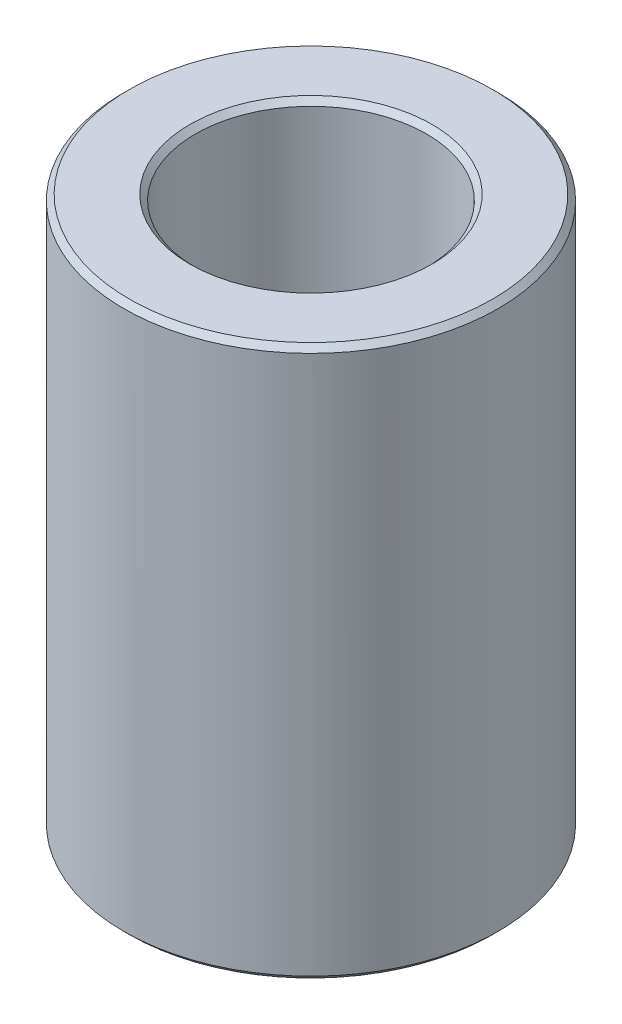
ISO-10303-21;
HEADER;
FILE_DESCRIPTION(('STEP AP214'),'2;1');
FILE_NAME('part.step','',(''),(''),'','','');
FILE_SCHEMA(('AUTOMOTIVE_DESIGN { 1 0 10303 214 1 1 1 1 }'));
ENDSEC;
DATA;
#1=APPLICATION_CONTEXT('core data for automotive mechanical design processes');
#2=APPLICATION_PROTOCOL_DEFINITION('international standard','automotive_design',2000,#1);
#3=PRODUCT_CONTEXT('',#1,'mechanical');
#4=PRODUCT('Part','Part','',(#3));
#5=PRODUCT_RELATED_PRODUCT_CATEGORY('part','',(#4));
#6=PRODUCT_DEFINITION_FORMATION('','',#4);
#7=PRODUCT_DEFINITION_CONTEXT('part definition',#1,'design');
#8=PRODUCT_DEFINITION('design','',#6,#7);
#9=PRODUCT_DEFINITION_SHAPE('','',#8);
#10=(LENGTH_UNIT() NAMED_UNIT(*) SI_UNIT(.MILLI.,.METRE.));
#11=(NAMED_UNIT(*) PLANE_ANGLE_UNIT() SI_UNIT($,.RADIAN.));
#12=(NAMED_UNIT(*) SI_UNIT($,.STERADIAN.) SOLID_ANGLE_UNIT());
#13=UNCERTAINTY_MEASURE_WITH_UNIT(LENGTH_MEASURE(1.E-05),#10,'distance_accuracy_value','');
#14=(GEOMETRIC_REPRESENTATION_CONTEXT(3) GLOBAL_UNCERTAINTY_ASSIGNED_CONTEXT((#13)) GLOBAL_UNIT_ASSIGNED_CONTEXT((#10,
#11,#12)) REPRESENTATION_CONTEXT('',''));
#15=CARTESIAN_POINT('',(0.,0.,0.));
#16=DIRECTION('',(0.,0.,1.));
#17=DIRECTION('',(1.,0.,0.));
#18=AXIS2_PLACEMENT_3D('',#15,#16,#17);
#19=CARTESIAN_POINT('',(0.,25.4,0.));
#20=DIRECTION('',(0.,-1.,0.));
#21=DIRECTION('',(0.,0.,-1.));
#22=AXIS2_PLACEMENT_3D('',#19,#20,#21);
#23=CYLINDRICAL_SURFACE('',#22,5.334);
#24=CARTESIAN_POINT('',(0.,0.254000000040833,0.));
#25=DIRECTION('',(0.,-1.,0.));
#26=DIRECTION('',(0.,0.,-1.));
#27=AXIS2_PLACEMENT_3D('',#24,#25,#26);
#28=CIRCLE('',#27,5.33400000000483);
#29=CARTESIAN_POINT('',(0.,0.254000000040833,-5.33400000000483));
#30=VERTEX_POINT('',#29);
#31=EDGE_CURVE('E30',#30,#30,#28,.T.);
#32=ORIENTED_EDGE('',*,*,#31,.T.);
#33=EDGE_LOOP('',(#32));
#34=FACE_BOUND('',#33,.T.);
#35=CARTESIAN_POINT('',(0.,25.1460000000066,0.));
#36=DIRECTION('',(0.,1.,0.));
#37=DIRECTION('',(0.,0.,1.));
#38=AXIS2_PLACEMENT_3D('',#35,#36,#37);
#39=CIRCLE('',#38,5.33400000000483);
#40=CARTESIAN_POINT('',(0.,25.1460000000066,5.33400000000483));
#41=VERTEX_POINT('',#40);
#42=EDGE_CURVE('E33',#41,#41,#39,.T.);
#43=ORIENTED_EDGE('',*,*,#42,.T.);
#44=EDGE_LOOP('',(#43));
#45=FACE_BOUND('',#44,.T.);
#46=ADVANCED_FACE('F15',(#34,#45),#23,.F.);
#47=CARTESIAN_POINT('',(0.,25.3999999999337,0.));
#48=DIRECTION('',(0.,1.,0.));
#49=DIRECTION('',(0.,0.,1.));
#50=AXIS2_PLACEMENT_3D('',#47,#48,#49);
#51=CONICAL_SURFACE('',#50,5.58799999993198,0.785398163397448);
#52=ORIENTED_EDGE('',*,*,#42,.F.);
#53=EDGE_LOOP('',(#52));
#54=FACE_BOUND('',#53,.T.);
#55=CARTESIAN_POINT('',(0.,25.3999999999905,0.));
#56=DIRECTION('',(0.,1.,0.));
#57=DIRECTION('',(0.,0.,1.));
#58=AXIS2_PLACEMENT_3D('',#55,#56,#57);
#59=CIRCLE('',#58,5.58799999998882);
#60=CARTESIAN_POINT('',(0.,25.3999999999905,5.58799999998882));
#61=VERTEX_POINT('',#60);
#62=EDGE_CURVE('E18',#61,#61,#59,.F.);
#63=ORIENTED_EDGE('',*,*,#62,.F.);
#64=EDGE_LOOP('',(#63));
#65=FACE_BOUND('',#64,.T.);
#66=ADVANCED_FACE('F49',(#54,#65),#51,.F.);
#67=CARTESIAN_POINT('',(0.,5.6843418860808E-11,0.));
#68=DIRECTION('',(0.,-1.,0.));
#69=DIRECTION('',(0.,0.,-1.));
#70=AXIS2_PLACEMENT_3D('',#67,#68,#69);
#71=CONICAL_SURFACE('',#70,5.58799999998882,0.785398163397448);
#72=CARTESIAN_POINT('',(0.,5.6843418860808E-11,0.));
#73=DIRECTION('',(0.,-1.,0.));
#74=DIRECTION('',(0.,0.,-1.));
#75=AXIS2_PLACEMENT_3D('',#72,#73,#74);
#76=CIRCLE('',#75,5.58799999998882);
#77=CARTESIAN_POINT('',(0.,5.6843418860808E-11,-5.58799999998882));
#78=VERTEX_POINT('',#77);
#79=EDGE_CURVE('E40',#78,#78,#76,.T.);
#80=ORIENTED_EDGE('',*,*,#79,.T.);
#81=EDGE_LOOP('',(#80));
#82=FACE_BOUND('',#81,.T.);
#83=ORIENTED_EDGE('',*,*,#31,.F.);
#84=EDGE_LOOP('',(#83));
#85=FACE_BOUND('',#84,.T.);
#86=ADVANCED_FACE('F51',(#82,#85),#71,.F.);
#87=CARTESIAN_POINT('',(0.,25.4,0.));
#88=DIRECTION('',(0.,1.,0.));
#89=DIRECTION('',(0.,0.,1.));
#90=AXIS2_PLACEMENT_3D('',#87,#88,#89);
#91=PLANE('',#90);
#92=CARTESIAN_POINT('',(0.,25.4,0.));
#93=DIRECTION('',(0.,-1.,0.));
#94=DIRECTION('',(1.,0.,0.));
#95=AXIS2_PLACEMENT_3D('',#92,#93,#94);
#96=CIRCLE('',#95,8.38200000000001);
#97=CARTESIAN_POINT('',(8.38200000000001,25.4,0.));
#98=VERTEX_POINT('',#97);
#99=EDGE_CURVE('E38',#98,#98,#96,.T.);
#100=ORIENTED_EDGE('',*,*,#99,.F.);
#101=EDGE_LOOP('',(#100));
#102=FACE_BOUND('',#101,.T.);
#103=ORIENTED_EDGE('',*,*,#62,.T.);
#104=EDGE_LOOP('',(#103));
#105=FACE_BOUND('',#104,.T.);
#106=ADVANCED_FACE('F47',(#102,#105),#91,.T.);
#107=CARTESIAN_POINT('',(0.,0.,0.));
#108=DIRECTION('',(0.,1.,0.));
#109=DIRECTION('',(0.,0.,1.));
#110=AXIS2_PLACEMENT_3D('',#107,#108,#109);
#111=PLANE('',#110);
#112=CARTESIAN_POINT('',(0.,0.,0.));
#113=DIRECTION('',(0.,1.,0.));
#114=DIRECTION('',(0.,0.,1.));
#115=AXIS2_PLACEMENT_3D('',#112,#113,#114);
#116=CIRCLE('',#115,8.382);
#117=CARTESIAN_POINT('',(0.,0.,8.382));
#118=VERTEX_POINT('',#117);
#119=EDGE_CURVE('E27',#118,#118,#116,.T.);
#120=ORIENTED_EDGE('',*,*,#119,.F.);
#121=EDGE_LOOP('',(#120));
#122=FACE_BOUND('',#121,.T.);
#123=ORIENTED_EDGE('',*,*,#79,.F.);
#124=EDGE_LOOP('',(#123));
#125=FACE_BOUND('',#124,.T.);
#126=ADVANCED_FACE('F75',(#122,#125),#111,.F.);
#127=CARTESIAN_POINT('',(0.,25.146,0.));
#128=DIRECTION('',(0.,-1.,0.));
#129=DIRECTION('',(1.,0.,0.));
#130=AXIS2_PLACEMENT_3D('',#127,#128,#129);
#131=CONICAL_SURFACE('',#130,8.636,0.785398163397438);
#132=CARTESIAN_POINT('',(0.,25.146,0.));
#133=DIRECTION('',(0.,-1.,0.));
#134=DIRECTION('',(0.,0.,-1.));
#135=AXIS2_PLACEMENT_3D('',#132,#133,#134);
#136=CIRCLE('',#135,8.636);
#137=CARTESIAN_POINT('',(0.,25.146,-8.636));
#138=VERTEX_POINT('',#137);
#139=EDGE_CURVE('E22',#138,#138,#136,.T.);
#140=ORIENTED_EDGE('',*,*,#139,.F.);
#141=EDGE_LOOP('',(#140));
#142=FACE_BOUND('',#141,.T.);
#143=ORIENTED_EDGE('',*,*,#99,.T.);
#144=EDGE_LOOP('',(#143));
#145=FACE_BOUND('',#144,.T.);
#146=ADVANCED_FACE('F68',(#142,#145),#131,.T.);
#147=CARTESIAN_POINT('',(0.,0.253999999999994,0.));
#148=DIRECTION('',(0.,1.,0.));
#149=DIRECTION('',(0.,0.,1.));
#150=AXIS2_PLACEMENT_3D('',#147,#148,#149);
#151=CONICAL_SURFACE('',#150,8.636,0.785398163397451);
#152=CARTESIAN_POINT('',(0.,0.253999999999994,0.));
#153=DIRECTION('',(0.,-1.,0.));
#154=DIRECTION('',(0.,0.,-1.));
#155=AXIS2_PLACEMENT_3D('',#152,#153,#154);
#156=CIRCLE('',#155,8.636);
#157=CARTESIAN_POINT('',(0.,0.253999999999994,-8.636));
#158=VERTEX_POINT('',#157);
#159=EDGE_CURVE('E10',#158,#158,#156,.F.);
#160=ORIENTED_EDGE('',*,*,#159,.F.);
#161=EDGE_LOOP('',(#160));
#162=FACE_BOUND('',#161,.T.);
#163=ORIENTED_EDGE('',*,*,#119,.T.);
#164=EDGE_LOOP('',(#163));
#165=FACE_BOUND('',#164,.T.);
#166=ADVANCED_FACE('F63',(#162,#165),#151,.T.);
#167=CARTESIAN_POINT('',(0.,25.4,0.));
#168=DIRECTION('',(0.,-1.,0.));
#169=DIRECTION('',(0.,0.,-1.));
#170=AXIS2_PLACEMENT_3D('',#167,#168,#169);
#171=CYLINDRICAL_SURFACE('',#170,8.636);
#172=ORIENTED_EDGE('',*,*,#159,.T.);
#173=EDGE_LOOP('',(#172));
#174=FACE_BOUND('',#173,.T.);
#175=ORIENTED_EDGE('',*,*,#139,.T.);
#176=EDGE_LOOP('',(#175));
#177=FACE_BOUND('',#176,.T.);
#178=ADVANCED_FACE('F61',(#174,#177),#171,.T.);
#179=CLOSED_SHELL('',(#46,#66,#86,#106,#126,#146,#166,#178));
#180=MANIFOLD_SOLID_BREP('B1',#179);
#181=ADVANCED_BREP_SHAPE_REPRESENTATION('',(#18,#180),#14);
#182=SHAPE_DEFINITION_REPRESENTATION(#9,#181);
ENDSEC;
END-ISO-10303-21;
